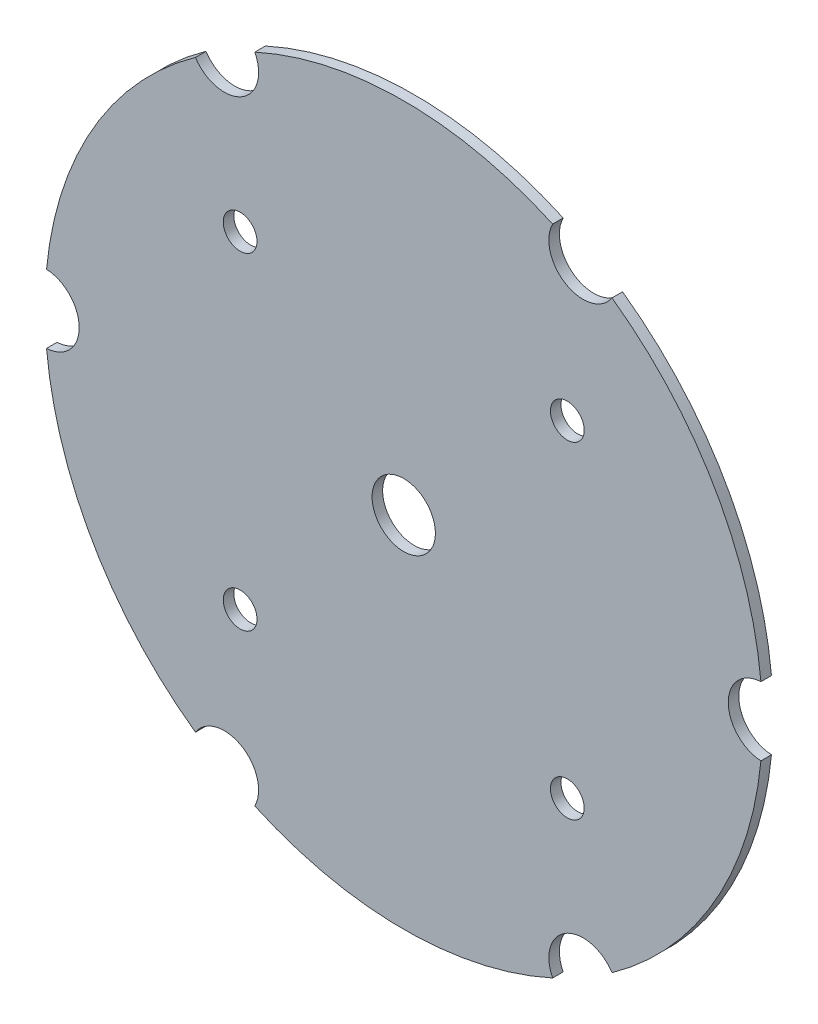
ISO-10303-21;
HEADER;
FILE_DESCRIPTION(('STEP AP214'),'2;1');
FILE_NAME('part.step','',(''),(''),'','','');
FILE_SCHEMA(('AUTOMOTIVE_DESIGN { 1 0 10303 214 1 1 1 1 }'));
ENDSEC;
DATA;
#1=APPLICATION_CONTEXT('core data for automotive mechanical design processes');
#2=APPLICATION_PROTOCOL_DEFINITION('international standard','automotive_design',2000,#1);
#3=PRODUCT_CONTEXT('',#1,'mechanical');
#4=PRODUCT('Part','Part','',(#3));
#5=PRODUCT_RELATED_PRODUCT_CATEGORY('part','',(#4));
#6=PRODUCT_DEFINITION_FORMATION('','',#4);
#7=PRODUCT_DEFINITION_CONTEXT('part definition',#1,'design');
#8=PRODUCT_DEFINITION('design','',#6,#7);
#9=PRODUCT_DEFINITION_SHAPE('','',#8);
#10=(LENGTH_UNIT() NAMED_UNIT(*) SI_UNIT(.MILLI.,.METRE.));
#11=(NAMED_UNIT(*) PLANE_ANGLE_UNIT() SI_UNIT($,.RADIAN.));
#12=(NAMED_UNIT(*) SI_UNIT($,.STERADIAN.) SOLID_ANGLE_UNIT());
#13=UNCERTAINTY_MEASURE_WITH_UNIT(LENGTH_MEASURE(1.E-05),#10,'distance_accuracy_value','');
#14=(GEOMETRIC_REPRESENTATION_CONTEXT(3) GLOBAL_UNCERTAINTY_ASSIGNED_CONTEXT((#13)) GLOBAL_UNIT_ASSIGNED_CONTEXT((#10,
#11,#12)) REPRESENTATION_CONTEXT('',''));
#15=CARTESIAN_POINT('',(0.,0.,0.));
#16=DIRECTION('',(0.,0.,1.));
#17=DIRECTION('',(1.,0.,0.));
#18=AXIS2_PLACEMENT_3D('',#15,#16,#17);
#19=CARTESIAN_POINT('',(17.,-29.4448637286709,1.));
#20=DIRECTION('',(0.,0.,-1.));
#21=DIRECTION('',(-1.,0.,0.));
#22=AXIS2_PLACEMENT_3D('',#19,#20,#21);
#23=CYLINDRICAL_SURFACE('',#22,3.25);
#24=CARTESIAN_POINT('',(17.,-29.4448637286709,0.));
#25=DIRECTION('',(0.,0.,1.));
#26=DIRECTION('',(1.,0.,0.));
#27=AXIS2_PLACEMENT_3D('',#24,#25,#26);
#28=CIRCLE('',#27,3.25);
#29=CARTESIAN_POINT('',(19.7337006391731,-27.6872002752806,0.));
#30=VERTEX_POINT('',#29);
#31=CARTESIAN_POINT('',(14.1109684784739,-30.9334862018415,0.));
#32=VERTEX_POINT('',#31);
#33=EDGE_CURVE('E256',#30,#32,#28,.T.);
#34=ORIENTED_EDGE('',*,*,#33,.F.);
#35=DIRECTION('',(0.,0.,-1.));
#36=VECTOR('',#35,1.);
#37=CARTESIAN_POINT('',(19.7337006391731,-27.6872002752806,1.));
#38=LINE('',#37,#36);
#39=CARTESIAN_POINT('',(19.7337006391731,-27.6872002752806,1.));
#40=VERTEX_POINT('',#39);
#41=EDGE_CURVE('E12',#40,#30,#38,.T.);
#42=ORIENTED_EDGE('',*,*,#41,.F.);
#43=CARTESIAN_POINT('',(17.,-29.4448637286709,1.));
#44=DIRECTION('',(0.,0.,1.));
#45=DIRECTION('',(1.,0.,0.));
#46=AXIS2_PLACEMENT_3D('',#43,#44,#45);
#47=CIRCLE('',#46,3.25);
#48=CARTESIAN_POINT('',(14.1109684784739,-30.9334862018415,1.));
#49=VERTEX_POINT('',#48);
#50=EDGE_CURVE('E176',#40,#49,#47,.T.);
#51=ORIENTED_EDGE('',*,*,#50,.T.);
#52=DIRECTION('',(0.,0.,-1.));
#53=VECTOR('',#52,1.);
#54=CARTESIAN_POINT('',(14.1109684784739,-30.9334862018415,1.));
#55=LINE('',#54,#53);
#56=EDGE_CURVE('E105',#49,#32,#55,.T.);
#57=ORIENTED_EDGE('',*,*,#56,.T.);
#58=EDGE_LOOP('',(#34,#42,#51,#57));
#59=FACE_BOUND('',#58,.T.);
#60=ADVANCED_FACE('F42',(#59),#23,.F.);
#61=CARTESIAN_POINT('',(0.,0.,1.));
#62=DIRECTION('',(0.,0.,-1.));
#63=DIRECTION('',(-1.,0.,0.));
#64=AXIS2_PLACEMENT_3D('',#61,#62,#63);
#65=CYLINDRICAL_SURFACE('',#64,34.);
#66=CARTESIAN_POINT('',(0.,0.,0.));
#67=DIRECTION('',(0.,0.,1.));
#68=DIRECTION('',(1.,0.,0.));
#69=AXIS2_PLACEMENT_3D('',#66,#67,#68);
#70=CIRCLE('',#69,34.);
#71=CARTESIAN_POINT('',(33.8446691176471,-3.24628592656086,0.));
#72=VERTEX_POINT('',#71);
#73=EDGE_CURVE('E221',#30,#72,#70,.T.);
#74=ORIENTED_EDGE('',*,*,#73,.T.);
#75=DIRECTION('',(0.,0.,-1.));
#76=VECTOR('',#75,1.);
#77=CARTESIAN_POINT('',(33.8446691176471,-3.24628592656086,1.));
#78=LINE('',#77,#76);
#79=CARTESIAN_POINT('',(33.8446691176471,-3.24628592656086,1.));
#80=VERTEX_POINT('',#79);
#81=EDGE_CURVE('E51',#80,#72,#78,.T.);
#82=ORIENTED_EDGE('',*,*,#81,.F.);
#83=CARTESIAN_POINT('',(0.,0.,1.));
#84=DIRECTION('',(0.,0.,1.));
#85=DIRECTION('',(1.,0.,0.));
#86=AXIS2_PLACEMENT_3D('',#83,#84,#85);
#87=CIRCLE('',#86,34.);
#88=EDGE_CURVE('E160',#40,#80,#87,.T.);
#89=ORIENTED_EDGE('',*,*,#88,.F.);
#90=ORIENTED_EDGE('',*,*,#41,.T.);
#91=EDGE_LOOP('',(#74,#82,#89,#90));
#92=FACE_BOUND('',#91,.T.);
#93=ADVANCED_FACE('F219',(#92),#65,.T.);
#94=CARTESIAN_POINT('',(34.,0.,1.));
#95=DIRECTION('',(0.,0.,-1.));
#96=DIRECTION('',(-1.,0.,0.));
#97=AXIS2_PLACEMENT_3D('',#94,#95,#96);
#98=CYLINDRICAL_SURFACE('',#97,3.25);
#99=CARTESIAN_POINT('',(34.,0.,0.));
#100=DIRECTION('',(0.,0.,1.));
#101=DIRECTION('',(1.,0.,0.));
#102=AXIS2_PLACEMENT_3D('',#99,#100,#101);
#103=CIRCLE('',#102,3.25);
#104=CARTESIAN_POINT('',(33.8446691176471,3.24628592656082,0.));
#105=VERTEX_POINT('',#104);
#106=EDGE_CURVE('E253',#105,#72,#103,.T.);
#107=ORIENTED_EDGE('',*,*,#106,.F.);
#108=DIRECTION('',(0.,0.,-1.));
#109=VECTOR('',#108,1.);
#110=CARTESIAN_POINT('',(33.8446691176471,3.24628592656082,1.));
#111=LINE('',#110,#109);
#112=CARTESIAN_POINT('',(33.8446691176471,3.24628592656082,1.));
#113=VERTEX_POINT('',#112);
#114=EDGE_CURVE('E217',#113,#105,#111,.T.);
#115=ORIENTED_EDGE('',*,*,#114,.F.);
#116=CARTESIAN_POINT('',(34.,0.,1.));
#117=DIRECTION('',(0.,0.,1.));
#118=DIRECTION('',(1.,0.,0.));
#119=AXIS2_PLACEMENT_3D('',#116,#117,#118);
#120=CIRCLE('',#119,3.25);
#121=EDGE_CURVE('E175',#113,#80,#120,.T.);
#122=ORIENTED_EDGE('',*,*,#121,.T.);
#123=ORIENTED_EDGE('',*,*,#81,.T.);
#124=EDGE_LOOP('',(#107,#115,#122,#123));
#125=FACE_BOUND('',#124,.T.);
#126=ADVANCED_FACE('F214',(#125),#98,.F.);
#127=CARTESIAN_POINT('',(19.7337006391732,27.6872002752806,0.));
#128=VERTEX_POINT('',#127);
#129=EDGE_CURVE('E252',#105,#128,#70,.T.);
#130=ORIENTED_EDGE('',*,*,#129,.T.);
#131=DIRECTION('',(0.,0.,-1.));
#132=VECTOR('',#131,1.);
#133=CARTESIAN_POINT('',(19.7337006391732,27.6872002752806,1.));
#134=LINE('',#133,#132);
#135=CARTESIAN_POINT('',(19.7337006391732,27.6872002752806,1.));
#136=VERTEX_POINT('',#135);
#137=EDGE_CURVE('E223',#136,#128,#134,.T.);
#138=ORIENTED_EDGE('',*,*,#137,.F.);
#139=EDGE_CURVE('E177',#113,#136,#87,.T.);
#140=ORIENTED_EDGE('',*,*,#139,.F.);
#141=ORIENTED_EDGE('',*,*,#114,.T.);
#142=EDGE_LOOP('',(#130,#138,#140,#141));
#143=FACE_BOUND('',#142,.T.);
#144=ADVANCED_FACE('F293',(#143),#65,.T.);
#145=CARTESIAN_POINT('',(17.,29.4448637286709,1.));
#146=DIRECTION('',(0.,0.,-1.));
#147=DIRECTION('',(-1.,0.,0.));
#148=AXIS2_PLACEMENT_3D('',#145,#146,#147);
#149=CYLINDRICAL_SURFACE('',#148,3.25);
#150=CARTESIAN_POINT('',(17.,29.4448637286709,0.));
#151=DIRECTION('',(0.,0.,1.));
#152=DIRECTION('',(1.,0.,0.));
#153=AXIS2_PLACEMENT_3D('',#150,#151,#152);
#154=CIRCLE('',#153,3.25);
#155=CARTESIAN_POINT('',(14.110968478474,30.9334862018414,0.));
#156=VERTEX_POINT('',#155);
#157=EDGE_CURVE('E249',#156,#128,#154,.T.);
#158=ORIENTED_EDGE('',*,*,#157,.F.);
#159=DIRECTION('',(0.,0.,-1.));
#160=VECTOR('',#159,1.);
#161=CARTESIAN_POINT('',(14.110968478474,30.9334862018414,1.));
#162=LINE('',#161,#160);
#163=CARTESIAN_POINT('',(14.110968478474,30.9334862018414,1.));
#164=VERTEX_POINT('',#163);
#165=EDGE_CURVE('E227',#164,#156,#162,.T.);
#166=ORIENTED_EDGE('',*,*,#165,.F.);
#167=CARTESIAN_POINT('',(17.,29.4448637286709,1.));
#168=DIRECTION('',(0.,0.,1.));
#169=DIRECTION('',(1.,0.,0.));
#170=AXIS2_PLACEMENT_3D('',#167,#168,#169);
#171=CIRCLE('',#170,3.25);
#172=EDGE_CURVE('E199',#164,#136,#171,.T.);
#173=ORIENTED_EDGE('',*,*,#172,.T.);
#174=ORIENTED_EDGE('',*,*,#137,.T.);
#175=EDGE_LOOP('',(#158,#166,#173,#174));
#176=FACE_BOUND('',#175,.T.);
#177=ADVANCED_FACE('F383',(#176),#149,.F.);
#178=CARTESIAN_POINT('',(-14.1109684784739,30.9334862018415,0.));
#179=VERTEX_POINT('',#178);
#180=EDGE_CURVE('E248',#156,#179,#70,.T.);
#181=ORIENTED_EDGE('',*,*,#180,.T.);
#182=DIRECTION('',(0.,0.,-1.));
#183=VECTOR('',#182,1.);
#184=CARTESIAN_POINT('',(-14.1109684784739,30.9334862018415,1.));
#185=LINE('',#184,#183);
#186=CARTESIAN_POINT('',(-14.1109684784739,30.9334862018415,1.));
#187=VERTEX_POINT('',#186);
#188=EDGE_CURVE('E229',#187,#179,#185,.T.);
#189=ORIENTED_EDGE('',*,*,#188,.F.);
#190=EDGE_CURVE('E198',#164,#187,#87,.T.);
#191=ORIENTED_EDGE('',*,*,#190,.F.);
#192=ORIENTED_EDGE('',*,*,#165,.T.);
#193=EDGE_LOOP('',(#181,#189,#191,#192));
#194=FACE_BOUND('',#193,.T.);
#195=ADVANCED_FACE('F381',(#194),#65,.T.);
#196=CARTESIAN_POINT('',(-17.,29.4448637286709,1.));
#197=DIRECTION('',(0.,0.,-1.));
#198=DIRECTION('',(-1.,0.,0.));
#199=AXIS2_PLACEMENT_3D('',#196,#197,#198);
#200=CYLINDRICAL_SURFACE('',#199,3.25);
#201=CARTESIAN_POINT('',(-17.,29.4448637286709,0.));
#202=DIRECTION('',(0.,0.,1.));
#203=DIRECTION('',(1.,0.,0.));
#204=AXIS2_PLACEMENT_3D('',#201,#202,#203);
#205=CIRCLE('',#204,3.25);
#206=CARTESIAN_POINT('',(-19.7337006391731,27.6872002752806,0.));
#207=VERTEX_POINT('',#206);
#208=EDGE_CURVE('E245',#207,#179,#205,.T.);
#209=ORIENTED_EDGE('',*,*,#208,.F.);
#210=DIRECTION('',(0.,0.,-1.));
#211=VECTOR('',#210,1.);
#212=CARTESIAN_POINT('',(-19.7337006391731,27.6872002752806,1.));
#213=LINE('',#212,#211);
#214=CARTESIAN_POINT('',(-19.7337006391731,27.6872002752806,1.));
#215=VERTEX_POINT('',#214);
#216=EDGE_CURVE('E231',#215,#207,#213,.T.);
#217=ORIENTED_EDGE('',*,*,#216,.F.);
#218=CARTESIAN_POINT('',(-17.,29.4448637286709,1.));
#219=DIRECTION('',(0.,0.,1.));
#220=DIRECTION('',(1.,0.,0.));
#221=AXIS2_PLACEMENT_3D('',#218,#219,#220);
#222=CIRCLE('',#221,3.25);
#223=EDGE_CURVE('E194',#215,#187,#222,.T.);
#224=ORIENTED_EDGE('',*,*,#223,.T.);
#225=ORIENTED_EDGE('',*,*,#188,.T.);
#226=EDGE_LOOP('',(#209,#217,#224,#225));
#227=FACE_BOUND('',#226,.T.);
#228=ADVANCED_FACE('F379',(#227),#200,.F.);
#229=CARTESIAN_POINT('',(-33.8446691176471,3.24628592656087,0.));
#230=VERTEX_POINT('',#229);
#231=EDGE_CURVE('E244',#207,#230,#70,.T.);
#232=ORIENTED_EDGE('',*,*,#231,.T.);
#233=DIRECTION('',(0.,0.,-1.));
#234=VECTOR('',#233,1.);
#235=CARTESIAN_POINT('',(-33.8446691176471,3.24628592656087,1.));
#236=LINE('',#235,#234);
#237=CARTESIAN_POINT('',(-33.8446691176471,3.24628592656087,1.));
#238=VERTEX_POINT('',#237);
#239=EDGE_CURVE('E233',#238,#230,#236,.T.);
#240=ORIENTED_EDGE('',*,*,#239,.F.);
#241=EDGE_CURVE('E145',#215,#238,#87,.T.);
#242=ORIENTED_EDGE('',*,*,#241,.F.);
#243=ORIENTED_EDGE('',*,*,#216,.T.);
#244=EDGE_LOOP('',(#232,#240,#242,#243));
#245=FACE_BOUND('',#244,.T.);
#246=ADVANCED_FACE('F377',(#245),#65,.T.);
#247=CARTESIAN_POINT('',(-34.,0.,1.));
#248=DIRECTION('',(0.,0.,-1.));
#249=DIRECTION('',(-1.,0.,0.));
#250=AXIS2_PLACEMENT_3D('',#247,#248,#249);
#251=CYLINDRICAL_SURFACE('',#250,3.25);
#252=CARTESIAN_POINT('',(-34.,0.,0.));
#253=DIRECTION('',(0.,0.,1.));
#254=DIRECTION('',(1.,0.,0.));
#255=AXIS2_PLACEMENT_3D('',#252,#253,#254);
#256=CIRCLE('',#255,3.25);
#257=CARTESIAN_POINT('',(-33.8446691176471,-3.24628592656081,0.));
#258=VERTEX_POINT('',#257);
#259=EDGE_CURVE('E241',#258,#230,#256,.T.);
#260=ORIENTED_EDGE('',*,*,#259,.F.);
#261=DIRECTION('',(0.,0.,-1.));
#262=VECTOR('',#261,1.);
#263=CARTESIAN_POINT('',(-33.8446691176471,-3.24628592656081,1.));
#264=LINE('',#263,#262);
#265=CARTESIAN_POINT('',(-33.8446691176471,-3.24628592656081,1.));
#266=VERTEX_POINT('',#265);
#267=EDGE_CURVE('E154',#266,#258,#264,.T.);
#268=ORIENTED_EDGE('',*,*,#267,.F.);
#269=CARTESIAN_POINT('',(-34.,0.,1.));
#270=DIRECTION('',(0.,0.,1.));
#271=DIRECTION('',(1.,0.,0.));
#272=AXIS2_PLACEMENT_3D('',#269,#270,#271);
#273=CIRCLE('',#272,3.25);
#274=EDGE_CURVE('E142',#266,#238,#273,.T.);
#275=ORIENTED_EDGE('',*,*,#274,.T.);
#276=ORIENTED_EDGE('',*,*,#239,.T.);
#277=EDGE_LOOP('',(#260,#268,#275,#276));
#278=FACE_BOUND('',#277,.T.);
#279=ADVANCED_FACE('F374',(#278),#251,.F.);
#280=CARTESIAN_POINT('',(-19.7337006391732,-27.6872002752805,0.));
#281=VERTEX_POINT('',#280);
#282=EDGE_CURVE('E150',#258,#281,#70,.T.);
#283=ORIENTED_EDGE('',*,*,#282,.T.);
#284=DIRECTION('',(0.,0.,-1.));
#285=VECTOR('',#284,1.);
#286=CARTESIAN_POINT('',(-19.7337006391732,-27.6872002752805,1.));
#287=LINE('',#286,#285);
#288=CARTESIAN_POINT('',(-19.7337006391732,-27.6872002752805,1.));
#289=VERTEX_POINT('',#288);
#290=EDGE_CURVE('E147',#289,#281,#287,.T.);
#291=ORIENTED_EDGE('',*,*,#290,.F.);
#292=EDGE_CURVE('E136',#266,#289,#87,.T.);
#293=ORIENTED_EDGE('',*,*,#292,.F.);
#294=ORIENTED_EDGE('',*,*,#267,.T.);
#295=EDGE_LOOP('',(#283,#291,#293,#294));
#296=FACE_BOUND('',#295,.T.);
#297=ADVANCED_FACE('F148',(#296),#65,.T.);
#298=CARTESIAN_POINT('',(-17.,-29.4448637286709,1.));
#299=DIRECTION('',(0.,0.,-1.));
#300=DIRECTION('',(-1.,0.,0.));
#301=AXIS2_PLACEMENT_3D('',#298,#299,#300);
#302=CYLINDRICAL_SURFACE('',#301,3.25000000000001);
#303=CARTESIAN_POINT('',(-17.,-29.4448637286709,0.));
#304=DIRECTION('',(0.,0.,1.));
#305=DIRECTION('',(1.,0.,0.));
#306=AXIS2_PLACEMENT_3D('',#303,#304,#305);
#307=CIRCLE('',#306,3.25000000000001);
#308=CARTESIAN_POINT('',(-14.1109684784739,-30.9334862018415,0.));
#309=VERTEX_POINT('',#308);
#310=EDGE_CURVE('E238',#309,#281,#307,.T.);
#311=ORIENTED_EDGE('',*,*,#310,.F.);
#312=DIRECTION('',(0.,0.,-1.));
#313=VECTOR('',#312,1.);
#314=CARTESIAN_POINT('',(-14.1109684784739,-30.9334862018415,1.));
#315=LINE('',#314,#313);
#316=CARTESIAN_POINT('',(-14.1109684784739,-30.9334862018415,1.));
#317=VERTEX_POINT('',#316);
#318=EDGE_CURVE('E98',#317,#309,#315,.T.);
#319=ORIENTED_EDGE('',*,*,#318,.F.);
#320=CARTESIAN_POINT('',(-17.,-29.4448637286709,1.));
#321=DIRECTION('',(0.,0.,1.));
#322=DIRECTION('',(1.,0.,0.));
#323=AXIS2_PLACEMENT_3D('',#320,#321,#322);
#324=CIRCLE('',#323,3.25000000000001);
#325=EDGE_CURVE('E140',#317,#289,#324,.T.);
#326=ORIENTED_EDGE('',*,*,#325,.T.);
#327=ORIENTED_EDGE('',*,*,#290,.T.);
#328=EDGE_LOOP('',(#311,#319,#326,#327));
#329=FACE_BOUND('',#328,.T.);
#330=ADVANCED_FACE('F156',(#329),#302,.F.);
#331=CARTESIAN_POINT('',(0.,0.,1.));
#332=DIRECTION('',(0.,0.,-1.));
#333=DIRECTION('',(-1.,0.,0.));
#334=AXIS2_PLACEMENT_3D('',#331,#332,#333);
#335=CYLINDRICAL_SURFACE('',#334,3.);
#336=CARTESIAN_POINT('',(0.,0.,1.));
#337=DIRECTION('',(0.,0.,1.));
#338=DIRECTION('',(1.,0.,0.));
#339=AXIS2_PLACEMENT_3D('',#336,#337,#338);
#340=CIRCLE('',#339,3.);
#341=CARTESIAN_POINT('',(3.,0.,1.));
#342=VERTEX_POINT('',#341);
#343=EDGE_CURVE('E357',#342,#342,#340,.T.);
#344=ORIENTED_EDGE('',*,*,#343,.T.);
#345=EDGE_LOOP('',(#344));
#346=FACE_BOUND('',#345,.T.);
#347=CARTESIAN_POINT('',(0.,0.,0.));
#348=DIRECTION('',(0.,0.,1.));
#349=DIRECTION('',(1.,0.,0.));
#350=AXIS2_PLACEMENT_3D('',#347,#348,#349);
#351=CIRCLE('',#350,3.);
#352=CARTESIAN_POINT('',(3.,0.,0.));
#353=VERTEX_POINT('',#352);
#354=EDGE_CURVE('E259',#353,#353,#351,.T.);
#355=ORIENTED_EDGE('',*,*,#354,.F.);
#356=EDGE_LOOP('',(#355));
#357=FACE_BOUND('',#356,.T.);
#358=ADVANCED_FACE('F297',(#346,#357),#335,.F.);
#359=CARTESIAN_POINT('',(-15.5,15.5,1.));
#360=DIRECTION('',(0.,0.,-1.));
#361=DIRECTION('',(-1.,0.,0.));
#362=AXIS2_PLACEMENT_3D('',#359,#360,#361);
#363=CYLINDRICAL_SURFACE('',#362,1.6);
#364=CARTESIAN_POINT('',(-15.5,15.5,1.));
#365=DIRECTION('',(0.,0.,1.));
#366=DIRECTION('',(1.,0.,0.));
#367=AXIS2_PLACEMENT_3D('',#364,#365,#366);
#368=CIRCLE('',#367,1.6);
#369=CARTESIAN_POINT('',(-13.9,15.5,1.));
#370=VERTEX_POINT('',#369);
#371=EDGE_CURVE('E353',#370,#370,#368,.T.);
#372=ORIENTED_EDGE('',*,*,#371,.T.);
#373=EDGE_LOOP('',(#372));
#374=FACE_BOUND('',#373,.T.);
#375=CARTESIAN_POINT('',(-15.5,15.5,0.));
#376=DIRECTION('',(0.,0.,1.));
#377=DIRECTION('',(1.,0.,0.));
#378=AXIS2_PLACEMENT_3D('',#375,#376,#377);
#379=CIRCLE('',#378,1.6);
#380=CARTESIAN_POINT('',(-13.9,15.5,0.));
#381=VERTEX_POINT('',#380);
#382=EDGE_CURVE('E262',#381,#381,#379,.T.);
#383=ORIENTED_EDGE('',*,*,#382,.F.);
#384=EDGE_LOOP('',(#383));
#385=FACE_BOUND('',#384,.T.);
#386=ADVANCED_FACE('F300',(#374,#385),#363,.F.);
#387=CARTESIAN_POINT('',(15.5,15.5,1.));
#388=DIRECTION('',(0.,0.,-1.));
#389=DIRECTION('',(-1.,0.,0.));
#390=AXIS2_PLACEMENT_3D('',#387,#388,#389);
#391=CYLINDRICAL_SURFACE('',#390,1.6);
#392=CARTESIAN_POINT('',(15.5,15.5,1.));
#393=DIRECTION('',(0.,0.,1.));
#394=DIRECTION('',(1.,0.,0.));
#395=AXIS2_PLACEMENT_3D('',#392,#393,#394);
#396=CIRCLE('',#395,1.6);
#397=CARTESIAN_POINT('',(17.1,15.5,1.));
#398=VERTEX_POINT('',#397);
#399=EDGE_CURVE('E312',#398,#398,#396,.T.);
#400=ORIENTED_EDGE('',*,*,#399,.T.);
#401=EDGE_LOOP('',(#400));
#402=FACE_BOUND('',#401,.T.);
#403=CARTESIAN_POINT('',(15.5,15.5,0.));
#404=DIRECTION('',(0.,0.,1.));
#405=DIRECTION('',(1.,0.,0.));
#406=AXIS2_PLACEMENT_3D('',#403,#404,#405);
#407=CIRCLE('',#406,1.6);
#408=CARTESIAN_POINT('',(17.1,15.5,0.));
#409=VERTEX_POINT('',#408);
#410=EDGE_CURVE('E265',#409,#409,#407,.T.);
#411=ORIENTED_EDGE('',*,*,#410,.F.);
#412=EDGE_LOOP('',(#411));
#413=FACE_BOUND('',#412,.T.);
#414=ADVANCED_FACE('F285',(#402,#413),#391,.F.);
#415=CARTESIAN_POINT('',(15.5,-15.5,1.));
#416=DIRECTION('',(0.,0.,-1.));
#417=DIRECTION('',(-1.,0.,0.));
#418=AXIS2_PLACEMENT_3D('',#415,#416,#417);
#419=CYLINDRICAL_SURFACE('',#418,1.6);
#420=CARTESIAN_POINT('',(15.5,-15.5,1.));
#421=DIRECTION('',(0.,0.,1.));
#422=DIRECTION('',(1.,0.,0.));
#423=AXIS2_PLACEMENT_3D('',#420,#421,#422);
#424=CIRCLE('',#423,1.6);
#425=CARTESIAN_POINT('',(17.1,-15.5,1.));
#426=VERTEX_POINT('',#425);
#427=EDGE_CURVE('E336',#426,#426,#424,.T.);
#428=ORIENTED_EDGE('',*,*,#427,.T.);
#429=EDGE_LOOP('',(#428));
#430=FACE_BOUND('',#429,.T.);
#431=CARTESIAN_POINT('',(15.5,-15.5,0.));
#432=DIRECTION('',(0.,0.,1.));
#433=DIRECTION('',(1.,0.,0.));
#434=AXIS2_PLACEMENT_3D('',#431,#432,#433);
#435=CIRCLE('',#434,1.6);
#436=CARTESIAN_POINT('',(17.1,-15.5,0.));
#437=VERTEX_POINT('',#436);
#438=EDGE_CURVE('E267',#437,#437,#435,.T.);
#439=ORIENTED_EDGE('',*,*,#438,.F.);
#440=EDGE_LOOP('',(#439));
#441=FACE_BOUND('',#440,.T.);
#442=ADVANCED_FACE('F278',(#430,#441),#419,.F.);
#443=CARTESIAN_POINT('',(-15.5,-15.5,1.));
#444=DIRECTION('',(0.,0.,-1.));
#445=DIRECTION('',(-1.,0.,0.));
#446=AXIS2_PLACEMENT_3D('',#443,#444,#445);
#447=CYLINDRICAL_SURFACE('',#446,1.6);
#448=CARTESIAN_POINT('',(-15.5,-15.5,1.));
#449=DIRECTION('',(0.,0.,1.));
#450=DIRECTION('',(1.,0.,0.));
#451=AXIS2_PLACEMENT_3D('',#448,#449,#450);
#452=CIRCLE('',#451,1.6);
#453=CARTESIAN_POINT('',(-13.9,-15.5,1.));
#454=VERTEX_POINT('',#453);
#455=EDGE_CURVE('E334',#454,#454,#452,.T.);
#456=ORIENTED_EDGE('',*,*,#455,.T.);
#457=EDGE_LOOP('',(#456));
#458=FACE_BOUND('',#457,.T.);
#459=CARTESIAN_POINT('',(-15.5,-15.5,0.));
#460=DIRECTION('',(0.,0.,1.));
#461=DIRECTION('',(1.,0.,0.));
#462=AXIS2_PLACEMENT_3D('',#459,#460,#461);
#463=CIRCLE('',#462,1.6);
#464=CARTESIAN_POINT('',(-13.9,-15.5,0.));
#465=VERTEX_POINT('',#464);
#466=EDGE_CURVE('E166',#465,#465,#463,.T.);
#467=ORIENTED_EDGE('',*,*,#466,.F.);
#468=EDGE_LOOP('',(#467));
#469=FACE_BOUND('',#468,.T.);
#470=ADVANCED_FACE('F44',(#458,#469),#447,.F.);
#471=EDGE_CURVE('E240',#309,#32,#70,.T.);
#472=ORIENTED_EDGE('',*,*,#471,.T.);
#473=ORIENTED_EDGE('',*,*,#56,.F.);
#474=EDGE_CURVE('E59',#317,#49,#87,.T.);
#475=ORIENTED_EDGE('',*,*,#474,.F.);
#476=ORIENTED_EDGE('',*,*,#318,.T.);
#477=EDGE_LOOP('',(#472,#473,#475,#476));
#478=FACE_BOUND('',#477,.T.);
#479=ADVANCED_FACE('F277',(#478),#65,.T.);
#480=CARTESIAN_POINT('',(0.,0.,1.));
#481=DIRECTION('',(0.,0.,1.));
#482=DIRECTION('',(1.,0.,0.));
#483=AXIS2_PLACEMENT_3D('',#480,#481,#482);
#484=PLANE('',#483);
#485=ORIENTED_EDGE('',*,*,#455,.F.);
#486=EDGE_LOOP('',(#485));
#487=FACE_BOUND('',#486,.T.);
#488=ORIENTED_EDGE('',*,*,#427,.F.);
#489=EDGE_LOOP('',(#488));
#490=FACE_BOUND('',#489,.T.);
#491=ORIENTED_EDGE('',*,*,#399,.F.);
#492=EDGE_LOOP('',(#491));
#493=FACE_BOUND('',#492,.T.);
#494=ORIENTED_EDGE('',*,*,#371,.F.);
#495=EDGE_LOOP('',(#494));
#496=FACE_BOUND('',#495,.T.);
#497=ORIENTED_EDGE('',*,*,#343,.F.);
#498=EDGE_LOOP('',(#497));
#499=FACE_BOUND('',#498,.T.);
#500=ORIENTED_EDGE('',*,*,#50,.F.);
#501=ORIENTED_EDGE('',*,*,#88,.T.);
#502=ORIENTED_EDGE('',*,*,#121,.F.);
#503=ORIENTED_EDGE('',*,*,#139,.T.);
#504=ORIENTED_EDGE('',*,*,#172,.F.);
#505=ORIENTED_EDGE('',*,*,#190,.T.);
#506=ORIENTED_EDGE('',*,*,#223,.F.);
#507=ORIENTED_EDGE('',*,*,#241,.T.);
#508=ORIENTED_EDGE('',*,*,#274,.F.);
#509=ORIENTED_EDGE('',*,*,#292,.T.);
#510=ORIENTED_EDGE('',*,*,#325,.F.);
#511=ORIENTED_EDGE('',*,*,#474,.T.);
#512=EDGE_LOOP('',(#500,#501,#502,#503,#504,#505,#506,#507,#508,#509,#510,#511));
#513=FACE_BOUND('',#512,.T.);
#514=ADVANCED_FACE('F138',(#487,#490,#493,#496,#499,#513),#484,.T.);
#515=CARTESIAN_POINT('',(0.,0.,0.));
#516=DIRECTION('',(0.,0.,1.));
#517=DIRECTION('',(1.,0.,0.));
#518=AXIS2_PLACEMENT_3D('',#515,#516,#517);
#519=PLANE('',#518);
#520=ORIENTED_EDGE('',*,*,#466,.T.);
#521=EDGE_LOOP('',(#520));
#522=FACE_BOUND('',#521,.T.);
#523=ORIENTED_EDGE('',*,*,#438,.T.);
#524=EDGE_LOOP('',(#523));
#525=FACE_BOUND('',#524,.T.);
#526=ORIENTED_EDGE('',*,*,#410,.T.);
#527=EDGE_LOOP('',(#526));
#528=FACE_BOUND('',#527,.T.);
#529=ORIENTED_EDGE('',*,*,#382,.T.);
#530=EDGE_LOOP('',(#529));
#531=FACE_BOUND('',#530,.T.);
#532=ORIENTED_EDGE('',*,*,#354,.T.);
#533=EDGE_LOOP('',(#532));
#534=FACE_BOUND('',#533,.T.);
#535=ORIENTED_EDGE('',*,*,#33,.T.);
#536=ORIENTED_EDGE('',*,*,#471,.F.);
#537=ORIENTED_EDGE('',*,*,#310,.T.);
#538=ORIENTED_EDGE('',*,*,#282,.F.);
#539=ORIENTED_EDGE('',*,*,#259,.T.);
#540=ORIENTED_EDGE('',*,*,#231,.F.);
#541=ORIENTED_EDGE('',*,*,#208,.T.);
#542=ORIENTED_EDGE('',*,*,#180,.F.);
#543=ORIENTED_EDGE('',*,*,#157,.T.);
#544=ORIENTED_EDGE('',*,*,#129,.F.);
#545=ORIENTED_EDGE('',*,*,#106,.T.);
#546=ORIENTED_EDGE('',*,*,#73,.F.);
#547=EDGE_LOOP('',(#535,#536,#537,#538,#539,#540,#541,#542,#543,#544,#545,#546));
#548=FACE_BOUND('',#547,.T.);
#549=ADVANCED_FACE('F274',(#522,#525,#528,#531,#534,#548),#519,.F.);
#550=CLOSED_SHELL('',(#60,#93,#126,#144,#177,#195,#228,#246,#279,#297,#330,#358,#386,#414,#442,
#470,#479,#514,#549));
#551=MANIFOLD_SOLID_BREP('B2',#550);
#552=ADVANCED_BREP_SHAPE_REPRESENTATION('',(#18,#551),#14);
#553=SHAPE_DEFINITION_REPRESENTATION(#9,#552);
ENDSEC;
END-ISO-10303-21;
